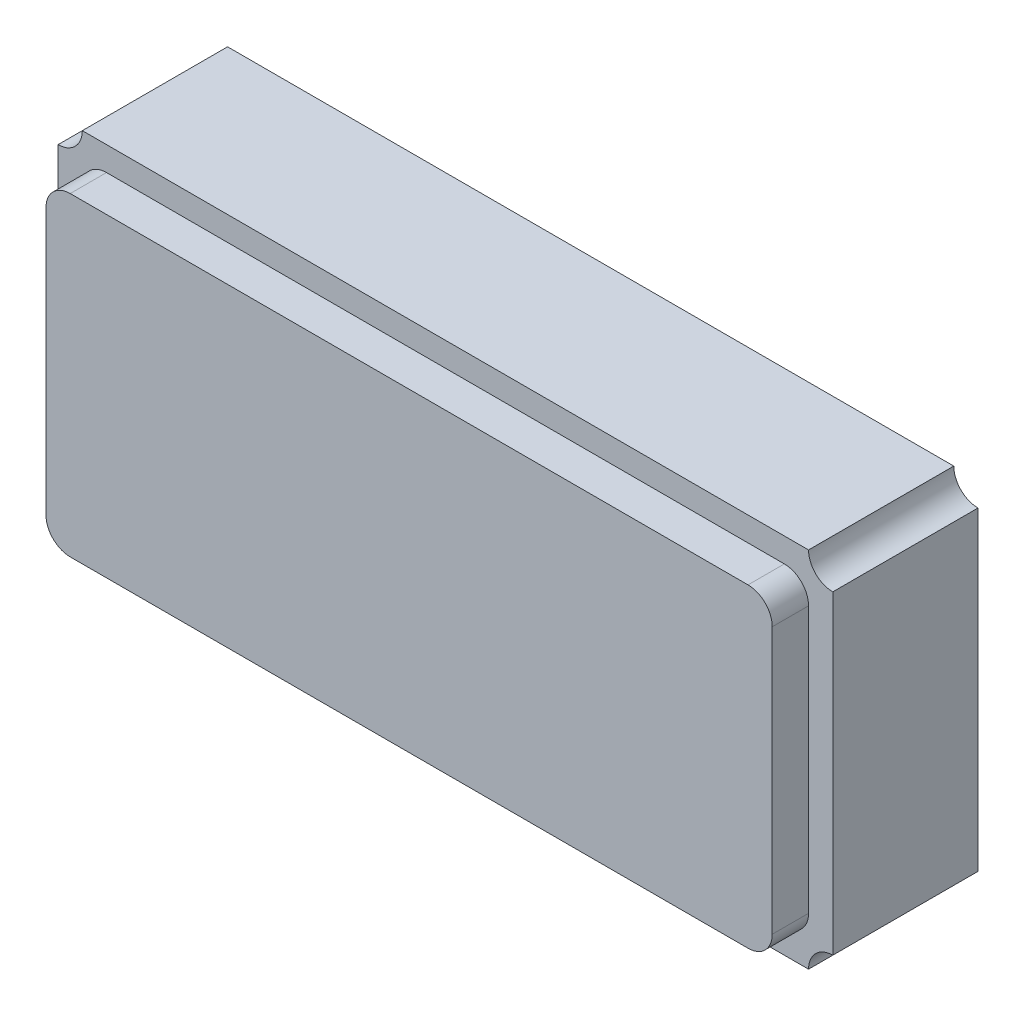
ISO-10303-21;
HEADER;
FILE_DESCRIPTION(('STEP AP214'),'2;1');
FILE_NAME('part.step','',(''),(''),'','','');
FILE_SCHEMA(('AUTOMOTIVE_DESIGN { 1 0 10303 214 1 1 1 1 }'));
ENDSEC;
DATA;
#1=APPLICATION_CONTEXT('core data for automotive mechanical design processes');
#2=APPLICATION_PROTOCOL_DEFINITION('international standard','automotive_design',2000,#1);
#3=PRODUCT_CONTEXT('',#1,'mechanical');
#4=PRODUCT('Part','Part','',(#3));
#5=PRODUCT_RELATED_PRODUCT_CATEGORY('part','',(#4));
#6=PRODUCT_DEFINITION_FORMATION('','',#4);
#7=PRODUCT_DEFINITION_CONTEXT('part definition',#1,'design');
#8=PRODUCT_DEFINITION('design','',#6,#7);
#9=PRODUCT_DEFINITION_SHAPE('','',#8);
#10=(LENGTH_UNIT() NAMED_UNIT(*) SI_UNIT(.MILLI.,.METRE.));
#11=(NAMED_UNIT(*) PLANE_ANGLE_UNIT() SI_UNIT($,.RADIAN.));
#12=(NAMED_UNIT(*) SI_UNIT($,.STERADIAN.) SOLID_ANGLE_UNIT());
#13=UNCERTAINTY_MEASURE_WITH_UNIT(LENGTH_MEASURE(1.E-05),#10,'distance_accuracy_value','');
#14=(GEOMETRIC_REPRESENTATION_CONTEXT(3) GLOBAL_UNCERTAINTY_ASSIGNED_CONTEXT((#13)) GLOBAL_UNIT_ASSIGNED_CONTEXT((#10,
#11,#12)) REPRESENTATION_CONTEXT('',''));
#15=CARTESIAN_POINT('',(0.,0.,0.));
#16=DIRECTION('',(0.,0.,1.));
#17=DIRECTION('',(1.,0.,0.));
#18=AXIS2_PLACEMENT_3D('',#15,#16,#17);
#19=CARTESIAN_POINT('',(3.20000571813639,2.04364228718976E-10,0.6));
#20=DIRECTION('',(0.,0.,-1.));
#21=DIRECTION('',(-1.,0.,0.));
#22=AXIS2_PLACEMENT_3D('',#19,#20,#21);
#23=PLANE('',#22);
#24=CARTESIAN_POINT('',(3.20000571813639,2.04364228718976E-10,0.6));
#25=DIRECTION('',(0.,0.,-1.));
#26=DIRECTION('',(-1.,0.,0.));
#27=AXIS2_PLACEMENT_3D('',#24,#25,#26);
#28=CIRCLE('',#27,0.099997140931804);
#29=CARTESIAN_POINT('',(3.10000857720459,0.,0.6));
#30=VERTEX_POINT('',#29);
#31=CARTESIAN_POINT('',(3.20000285902466,0.0999971410952943,0.6));
#32=VERTEX_POINT('',#31);
#33=EDGE_CURVE('E156',#30,#32,#28,.T.);
#34=ORIENTED_EDGE('',*,*,#33,.T.);
#35=DIRECTION('',(0.,1.,0.));
#36=VECTOR('',#35,1.);
#37=CARTESIAN_POINT('',(3.20000285902466,0.0999971410952943,0.6));
#38=LINE('',#37,#36);
#39=CARTESIAN_POINT('',(3.20000285902466,1.40000285910907,0.6));
#40=VERTEX_POINT('',#39);
#41=EDGE_CURVE('E145',#32,#40,#38,.T.);
#42=ORIENTED_EDGE('',*,*,#41,.T.);
#43=CARTESIAN_POINT('',(3.2,1.5,0.6));
#44=DIRECTION('',(0.,0.,-1.));
#45=DIRECTION('',(-1.,0.,0.));
#46=AXIS2_PLACEMENT_3D('',#43,#44,#45);
#47=CIRCLE('',#46,0.0999971409318037);
#48=CARTESIAN_POINT('',(3.1000028590682,1.5,0.6));
#49=VERTEX_POINT('',#48);
#50=EDGE_CURVE('E155',#40,#49,#47,.T.);
#51=ORIENTED_EDGE('',*,*,#50,.T.);
#52=DIRECTION('',(-1.,0.,0.));
#53=VECTOR('',#52,1.);
#54=CARTESIAN_POINT('',(0.100002859068196,1.5,0.6));
#55=LINE('',#54,#53);
#56=CARTESIAN_POINT('',(0.100002859068196,1.5,0.6));
#57=VERTEX_POINT('',#56);
#58=EDGE_CURVE('E243',#49,#57,#55,.T.);
#59=ORIENTED_EDGE('',*,*,#58,.T.);
#60=CARTESIAN_POINT('',(0.,1.5,0.6));
#61=DIRECTION('',(0.,0.,-1.));
#62=DIRECTION('',(-1.,0.,0.));
#63=AXIS2_PLACEMENT_3D('',#60,#61,#62);
#64=CIRCLE('',#63,0.100002859068196);
#65=CARTESIAN_POINT('',(0.,1.3999971409318,0.6));
#66=VERTEX_POINT('',#65);
#67=EDGE_CURVE('E245',#57,#66,#64,.T.);
#68=ORIENTED_EDGE('',*,*,#67,.T.);
#69=DIRECTION('',(0.,-1.,0.));
#70=VECTOR('',#69,1.);
#71=CARTESIAN_POINT('',(0.,0.0999971409318039,0.6));
#72=LINE('',#71,#70);
#73=CARTESIAN_POINT('',(0.,0.0999971409318039,0.6));
#74=VERTEX_POINT('',#73);
#75=EDGE_CURVE('E247',#66,#74,#72,.T.);
#76=ORIENTED_EDGE('',*,*,#75,.T.);
#77=CARTESIAN_POINT('',(0.,0.,0.6));
#78=DIRECTION('',(0.,0.,-1.));
#79=DIRECTION('',(1.,0.,0.));
#80=AXIS2_PLACEMENT_3D('',#77,#78,#79);
#81=CIRCLE('',#80,0.0999971409318039);
#82=CARTESIAN_POINT('',(0.0999971409318039,0.,0.6));
#83=VERTEX_POINT('',#82);
#84=EDGE_CURVE('E249',#74,#83,#81,.T.);
#85=ORIENTED_EDGE('',*,*,#84,.T.);
#86=DIRECTION('',(1.,0.,0.));
#87=VECTOR('',#86,1.);
#88=CARTESIAN_POINT('',(0.0999971409318039,0.,0.6));
#89=LINE('',#88,#87);
#90=EDGE_CURVE('E160',#83,#30,#89,.T.);
#91=ORIENTED_EDGE('',*,*,#90,.T.);
#92=EDGE_LOOP('',(#34,#42,#51,#59,#68,#76,#85,#91));
#93=FACE_BOUND('',#92,.T.);
#94=DIRECTION('',(0.,-1.,0.));
#95=VECTOR('',#94,1.);
#96=CARTESIAN_POINT('',(0.100002859068196,1.3999971409318,0.6));
#97=LINE('',#96,#95);
#98=CARTESIAN_POINT('',(0.100002859068196,1.2999971409318,0.6));
#99=VERTEX_POINT('',#98);
#100=CARTESIAN_POINT('',(0.100002859068196,0.199997140931803,0.6));
#101=VERTEX_POINT('',#100);
#102=EDGE_CURVE('E206',#99,#101,#97,.T.);
#103=ORIENTED_EDGE('',*,*,#102,.F.);
#104=CARTESIAN_POINT('',(0.200002859068196,1.2999971409318,0.6));
#105=DIRECTION('',(0.,0.,-1.));
#106=DIRECTION('',(-1.,0.,0.));
#107=AXIS2_PLACEMENT_3D('',#104,#105,#106);
#108=CIRCLE('',#107,0.1);
#109=CARTESIAN_POINT('',(0.200002859068196,1.3999971409318,0.6));
#110=VERTEX_POINT('',#109);
#111=EDGE_CURVE('E203',#99,#110,#108,.T.);
#112=ORIENTED_EDGE('',*,*,#111,.T.);
#113=DIRECTION('',(-1.,0.,0.));
#114=VECTOR('',#113,1.);
#115=CARTESIAN_POINT('',(0.100002859068196,1.3999971409318,0.6));
#116=LINE('',#115,#114);
#117=CARTESIAN_POINT('',(3.0000028590682,1.3999971409318,0.6));
#118=VERTEX_POINT('',#117);
#119=EDGE_CURVE('E231',#118,#110,#116,.T.);
#120=ORIENTED_EDGE('',*,*,#119,.F.);
#121=CARTESIAN_POINT('',(3.0000028590682,1.2999971409318,0.6));
#122=DIRECTION('',(0.,0.,-1.));
#123=DIRECTION('',(-1.,0.,0.));
#124=AXIS2_PLACEMENT_3D('',#121,#122,#123);
#125=CIRCLE('',#124,0.1);
#126=CARTESIAN_POINT('',(3.1000028590682,1.2999971409318,0.6));
#127=VERTEX_POINT('',#126);
#128=EDGE_CURVE('E201',#118,#127,#125,.T.);
#129=ORIENTED_EDGE('',*,*,#128,.T.);
#130=DIRECTION('',(0.,1.,0.));
#131=VECTOR('',#130,1.);
#132=CARTESIAN_POINT('',(3.1000028590682,1.3999971409318,0.6));
#133=LINE('',#132,#131);
#134=CARTESIAN_POINT('',(3.1000028590682,0.199997140931804,0.6));
#135=VERTEX_POINT('',#134);
#136=EDGE_CURVE('E237',#135,#127,#133,.T.);
#137=ORIENTED_EDGE('',*,*,#136,.F.);
#138=CARTESIAN_POINT('',(3.0000028590682,0.199997140931804,0.6));
#139=DIRECTION('',(0.,0.,-1.));
#140=DIRECTION('',(-1.,0.,0.));
#141=AXIS2_PLACEMENT_3D('',#138,#139,#140);
#142=CIRCLE('',#141,0.1);
#143=CARTESIAN_POINT('',(3.0000028590682,0.099997140931804,0.6));
#144=VERTEX_POINT('',#143);
#145=EDGE_CURVE('E11',#135,#144,#142,.T.);
#146=ORIENTED_EDGE('',*,*,#145,.T.);
#147=DIRECTION('',(1.,0.,0.));
#148=VECTOR('',#147,1.);
#149=CARTESIAN_POINT('',(0.100002859068196,0.0999971409318033,0.6));
#150=LINE('',#149,#148);
#151=CARTESIAN_POINT('',(0.200002859068196,0.0999971409318033,0.6));
#152=VERTEX_POINT('',#151);
#153=EDGE_CURVE('E207',#152,#144,#150,.T.);
#154=ORIENTED_EDGE('',*,*,#153,.F.);
#155=CARTESIAN_POINT('',(0.200002859068196,0.199997140931803,0.6));
#156=DIRECTION('',(0.,0.,-1.));
#157=DIRECTION('',(-1.,0.,0.));
#158=AXIS2_PLACEMENT_3D('',#155,#156,#157);
#159=CIRCLE('',#158,0.1);
#160=EDGE_CURVE('E41',#152,#101,#159,.T.);
#161=ORIENTED_EDGE('',*,*,#160,.T.);
#162=EDGE_LOOP('',(#103,#112,#120,#129,#137,#146,#154,#161));
#163=FACE_BOUND('',#162,.T.);
#164=ADVANCED_FACE('F33',(#93,#163),#23,.F.);
#165=CARTESIAN_POINT('',(3.20000571813639,2.04364228718976E-10,0.6));
#166=DIRECTION('',(0.,0.,-1.));
#167=DIRECTION('',(-1.,0.,0.));
#168=AXIS2_PLACEMENT_3D('',#165,#166,#167);
#169=CYLINDRICAL_SURFACE('',#168,0.099997140931804);
#170=CARTESIAN_POINT('',(3.20000571813639,2.04364228718976E-10,0.));
#171=DIRECTION('',(0.,0.,-1.));
#172=DIRECTION('',(-1.,0.,0.));
#173=AXIS2_PLACEMENT_3D('',#170,#171,#172);
#174=CIRCLE('',#173,0.099997140931804);
#175=CARTESIAN_POINT('',(3.10000857720459,0.,0.));
#176=VERTEX_POINT('',#175);
#177=CARTESIAN_POINT('',(3.20000285902466,0.0999971410952943,0.));
#178=VERTEX_POINT('',#177);
#179=EDGE_CURVE('E168',#176,#178,#174,.T.);
#180=ORIENTED_EDGE('',*,*,#179,.T.);
#181=DIRECTION('',(0.,0.,-1.));
#182=VECTOR('',#181,1.);
#183=CARTESIAN_POINT('',(3.20000285902466,0.0999971410952943,0.6));
#184=LINE('',#183,#182);
#185=EDGE_CURVE('E149',#32,#178,#184,.T.);
#186=ORIENTED_EDGE('',*,*,#185,.F.);
#187=ORIENTED_EDGE('',*,*,#33,.F.);
#188=DIRECTION('',(0.,0.,-1.));
#189=VECTOR('',#188,1.);
#190=CARTESIAN_POINT('',(3.10000857720459,0.,0.6));
#191=LINE('',#190,#189);
#192=EDGE_CURVE('E252',#30,#176,#191,.T.);
#193=ORIENTED_EDGE('',*,*,#192,.T.);
#194=EDGE_LOOP('',(#180,#186,#187,#193));
#195=FACE_BOUND('',#194,.T.);
#196=ADVANCED_FACE('F166',(#195),#169,.F.);
#197=CARTESIAN_POINT('',(3.20000285902466,0.0999971410952943,0.6));
#198=DIRECTION('',(-1.,0.,0.));
#199=DIRECTION('',(0.,0.,1.));
#200=AXIS2_PLACEMENT_3D('',#197,#198,#199);
#201=PLANE('',#200);
#202=DIRECTION('',(0.,1.,0.));
#203=VECTOR('',#202,1.);
#204=CARTESIAN_POINT('',(3.20000285902466,0.0999971410952943,0.));
#205=LINE('',#204,#203);
#206=CARTESIAN_POINT('',(3.20000285902466,1.40000285910907,0.));
#207=VERTEX_POINT('',#206);
#208=EDGE_CURVE('E254',#178,#207,#205,.T.);
#209=ORIENTED_EDGE('',*,*,#208,.T.);
#210=DIRECTION('',(0.,0.,-1.));
#211=VECTOR('',#210,1.);
#212=CARTESIAN_POINT('',(3.20000285902466,1.40000285910907,0.6));
#213=LINE('',#212,#211);
#214=EDGE_CURVE('E152',#40,#207,#213,.T.);
#215=ORIENTED_EDGE('',*,*,#214,.F.);
#216=ORIENTED_EDGE('',*,*,#41,.F.);
#217=ORIENTED_EDGE('',*,*,#185,.T.);
#218=EDGE_LOOP('',(#209,#215,#216,#217));
#219=FACE_BOUND('',#218,.T.);
#220=ADVANCED_FACE('F147',(#219),#201,.F.);
#221=CARTESIAN_POINT('',(3.2,1.5,0.6));
#222=DIRECTION('',(0.,0.,-1.));
#223=DIRECTION('',(-1.,0.,0.));
#224=AXIS2_PLACEMENT_3D('',#221,#222,#223);
#225=CYLINDRICAL_SURFACE('',#224,0.0999971409318037);
#226=CARTESIAN_POINT('',(3.2,1.5,0.));
#227=DIRECTION('',(0.,0.,-1.));
#228=DIRECTION('',(-1.,0.,0.));
#229=AXIS2_PLACEMENT_3D('',#226,#227,#228);
#230=CIRCLE('',#229,0.0999971409318037);
#231=CARTESIAN_POINT('',(3.1000028590682,1.5,0.));
#232=VERTEX_POINT('',#231);
#233=EDGE_CURVE('E256',#207,#232,#230,.T.);
#234=ORIENTED_EDGE('',*,*,#233,.T.);
#235=DIRECTION('',(0.,0.,-1.));
#236=VECTOR('',#235,1.);
#237=CARTESIAN_POINT('',(3.1000028590682,1.5,0.6));
#238=LINE('',#237,#236);
#239=EDGE_CURVE('E173',#49,#232,#238,.T.);
#240=ORIENTED_EDGE('',*,*,#239,.F.);
#241=ORIENTED_EDGE('',*,*,#50,.F.);
#242=ORIENTED_EDGE('',*,*,#214,.T.);
#243=EDGE_LOOP('',(#234,#240,#241,#242));
#244=FACE_BOUND('',#243,.T.);
#245=ADVANCED_FACE('F303',(#244),#225,.F.);
#246=CARTESIAN_POINT('',(0.100002859068196,1.5,0.6));
#247=DIRECTION('',(0.,-1.,0.));
#248=DIRECTION('',(1.,0.,0.));
#249=AXIS2_PLACEMENT_3D('',#246,#247,#248);
#250=PLANE('',#249);
#251=DIRECTION('',(-1.,0.,0.));
#252=VECTOR('',#251,1.);
#253=CARTESIAN_POINT('',(0.100002859068196,1.5,0.));
#254=LINE('',#253,#252);
#255=CARTESIAN_POINT('',(0.100002859068196,1.5,0.));
#256=VERTEX_POINT('',#255);
#257=EDGE_CURVE('E258',#232,#256,#254,.T.);
#258=ORIENTED_EDGE('',*,*,#257,.T.);
#259=DIRECTION('',(0.,0.,-1.));
#260=VECTOR('',#259,1.);
#261=CARTESIAN_POINT('',(0.100002859068196,1.5,0.6));
#262=LINE('',#261,#260);
#263=EDGE_CURVE('E277',#57,#256,#262,.T.);
#264=ORIENTED_EDGE('',*,*,#263,.F.);
#265=ORIENTED_EDGE('',*,*,#58,.F.);
#266=ORIENTED_EDGE('',*,*,#239,.T.);
#267=EDGE_LOOP('',(#258,#264,#265,#266));
#268=FACE_BOUND('',#267,.T.);
#269=ADVANCED_FACE('F284',(#268),#250,.F.);
#270=CARTESIAN_POINT('',(0.,1.5,0.6));
#271=DIRECTION('',(0.,0.,-1.));
#272=DIRECTION('',(-1.,0.,0.));
#273=AXIS2_PLACEMENT_3D('',#270,#271,#272);
#274=CYLINDRICAL_SURFACE('',#273,0.100002859068196);
#275=CARTESIAN_POINT('',(0.,1.5,0.));
#276=DIRECTION('',(0.,0.,-1.));
#277=DIRECTION('',(-1.,0.,0.));
#278=AXIS2_PLACEMENT_3D('',#275,#276,#277);
#279=CIRCLE('',#278,0.100002859068196);
#280=CARTESIAN_POINT('',(0.,1.3999971409318,0.));
#281=VERTEX_POINT('',#280);
#282=EDGE_CURVE('E260',#256,#281,#279,.T.);
#283=ORIENTED_EDGE('',*,*,#282,.T.);
#284=DIRECTION('',(0.,0.,-1.));
#285=VECTOR('',#284,1.);
#286=CARTESIAN_POINT('',(0.,1.3999971409318,0.6));
#287=LINE('',#286,#285);
#288=EDGE_CURVE('E274',#66,#281,#287,.T.);
#289=ORIENTED_EDGE('',*,*,#288,.F.);
#290=ORIENTED_EDGE('',*,*,#67,.F.);
#291=ORIENTED_EDGE('',*,*,#263,.T.);
#292=EDGE_LOOP('',(#283,#289,#290,#291));
#293=FACE_BOUND('',#292,.T.);
#294=ADVANCED_FACE('F295',(#293),#274,.F.);
#295=CARTESIAN_POINT('',(0.,0.0999971409318039,0.6));
#296=DIRECTION('',(1.,0.,0.));
#297=DIRECTION('',(0.,0.,-1.));
#298=AXIS2_PLACEMENT_3D('',#295,#296,#297);
#299=PLANE('',#298);
#300=DIRECTION('',(0.,-1.,0.));
#301=VECTOR('',#300,1.);
#302=CARTESIAN_POINT('',(0.,0.0999971409318039,0.));
#303=LINE('',#302,#301);
#304=CARTESIAN_POINT('',(0.,0.0999971409318039,0.));
#305=VERTEX_POINT('',#304);
#306=EDGE_CURVE('E262',#281,#305,#303,.T.);
#307=ORIENTED_EDGE('',*,*,#306,.T.);
#308=DIRECTION('',(0.,0.,-1.));
#309=VECTOR('',#308,1.);
#310=CARTESIAN_POINT('',(0.,0.0999971409318039,0.6));
#311=LINE('',#310,#309);
#312=EDGE_CURVE('E271',#74,#305,#311,.T.);
#313=ORIENTED_EDGE('',*,*,#312,.F.);
#314=ORIENTED_EDGE('',*,*,#75,.F.);
#315=ORIENTED_EDGE('',*,*,#288,.T.);
#316=EDGE_LOOP('',(#307,#313,#314,#315));
#317=FACE_BOUND('',#316,.T.);
#318=ADVANCED_FACE('F299',(#317),#299,.F.);
#319=CARTESIAN_POINT('',(0.,0.,0.6));
#320=DIRECTION('',(0.,0.,-1.));
#321=DIRECTION('',(-1.,0.,0.));
#322=AXIS2_PLACEMENT_3D('',#319,#320,#321);
#323=CYLINDRICAL_SURFACE('',#322,0.0999971409318039);
#324=CARTESIAN_POINT('',(0.,0.,0.));
#325=DIRECTION('',(0.,0.,-1.));
#326=DIRECTION('',(1.,0.,0.));
#327=AXIS2_PLACEMENT_3D('',#324,#325,#326);
#328=CIRCLE('',#327,0.0999971409318039);
#329=CARTESIAN_POINT('',(0.0999971409318039,0.,0.));
#330=VERTEX_POINT('',#329);
#331=EDGE_CURVE('E264',#305,#330,#328,.T.);
#332=ORIENTED_EDGE('',*,*,#331,.T.);
#333=DIRECTION('',(0.,0.,-1.));
#334=VECTOR('',#333,1.);
#335=CARTESIAN_POINT('',(0.0999971409318039,0.,0.6));
#336=LINE('',#335,#334);
#337=EDGE_CURVE('E268',#83,#330,#336,.T.);
#338=ORIENTED_EDGE('',*,*,#337,.F.);
#339=ORIENTED_EDGE('',*,*,#84,.F.);
#340=ORIENTED_EDGE('',*,*,#312,.T.);
#341=EDGE_LOOP('',(#332,#338,#339,#340));
#342=FACE_BOUND('',#341,.T.);
#343=ADVANCED_FACE('F326',(#342),#323,.F.);
#344=CARTESIAN_POINT('',(0.0999971409318039,0.,0.6));
#345=DIRECTION('',(0.,1.,0.));
#346=DIRECTION('',(-1.,0.,0.));
#347=AXIS2_PLACEMENT_3D('',#344,#345,#346);
#348=PLANE('',#347);
#349=DIRECTION('',(1.,0.,0.));
#350=VECTOR('',#349,1.);
#351=CARTESIAN_POINT('',(0.0999971409318039,0.,0.));
#352=LINE('',#351,#350);
#353=EDGE_CURVE('E164',#330,#176,#352,.T.);
#354=ORIENTED_EDGE('',*,*,#353,.T.);
#355=ORIENTED_EDGE('',*,*,#192,.F.);
#356=ORIENTED_EDGE('',*,*,#90,.F.);
#357=ORIENTED_EDGE('',*,*,#337,.T.);
#358=EDGE_LOOP('',(#354,#355,#356,#357));
#359=FACE_BOUND('',#358,.T.);
#360=ADVANCED_FACE('F323',(#359),#348,.F.);
#361=CARTESIAN_POINT('',(3.20000571813639,2.04364228718976E-10,0.));
#362=DIRECTION('',(0.,0.,-1.));
#363=DIRECTION('',(-1.,0.,0.));
#364=AXIS2_PLACEMENT_3D('',#361,#362,#363);
#365=PLANE('',#364);
#366=ORIENTED_EDGE('',*,*,#179,.F.);
#367=ORIENTED_EDGE('',*,*,#353,.F.);
#368=ORIENTED_EDGE('',*,*,#331,.F.);
#369=ORIENTED_EDGE('',*,*,#306,.F.);
#370=ORIENTED_EDGE('',*,*,#282,.F.);
#371=ORIENTED_EDGE('',*,*,#257,.F.);
#372=ORIENTED_EDGE('',*,*,#233,.F.);
#373=ORIENTED_EDGE('',*,*,#208,.F.);
#374=EDGE_LOOP('',(#366,#367,#368,#369,#370,#371,#372,#373));
#375=FACE_BOUND('',#374,.T.);
#376=ADVANCED_FACE('F290',(#375),#365,.T.);
#377=CARTESIAN_POINT('',(0.100002859068196,1.3999971409318,0.75));
#378=DIRECTION('',(1.,0.,0.));
#379=DIRECTION('',(0.,1.,0.));
#380=AXIS2_PLACEMENT_3D('',#377,#378,#379);
#381=PLANE('',#380);
#382=DIRECTION('',(0.,-1.,0.));
#383=VECTOR('',#382,1.);
#384=CARTESIAN_POINT('',(0.100002859068196,1.3999971409318,0.75));
#385=LINE('',#384,#383);
#386=CARTESIAN_POINT('',(0.100002859068196,1.2999971409318,0.75));
#387=VERTEX_POINT('',#386);
#388=CARTESIAN_POINT('',(0.100002859068196,0.199997140931803,0.75));
#389=VERTEX_POINT('',#388);
#390=EDGE_CURVE('E223',#387,#389,#385,.T.);
#391=ORIENTED_EDGE('',*,*,#390,.F.);
#392=DIRECTION('',(0.,0.,-1.));
#393=VECTOR('',#392,1.);
#394=CARTESIAN_POINT('',(0.100002859068196,1.2999971409318,0.75));
#395=LINE('',#394,#393);
#396=EDGE_CURVE('E194',#387,#99,#395,.T.);
#397=ORIENTED_EDGE('',*,*,#396,.T.);
#398=ORIENTED_EDGE('',*,*,#102,.T.);
#399=DIRECTION('',(0.,0.,-1.));
#400=VECTOR('',#399,1.);
#401=CARTESIAN_POINT('',(0.100002859068196,0.199997140931803,0.75));
#402=LINE('',#401,#400);
#403=EDGE_CURVE('E192',#101,#389,#402,.F.);
#404=ORIENTED_EDGE('',*,*,#403,.T.);
#405=EDGE_LOOP('',(#391,#397,#398,#404));
#406=FACE_BOUND('',#405,.T.);
#407=ADVANCED_FACE('F210',(#406),#381,.F.);
#408=CARTESIAN_POINT('',(0.100002859068196,0.0999971409318033,0.75));
#409=DIRECTION('',(0.,1.,0.));
#410=DIRECTION('',(-1.,0.,0.));
#411=AXIS2_PLACEMENT_3D('',#408,#409,#410);
#412=PLANE('',#411);
#413=DIRECTION('',(1.,0.,0.));
#414=VECTOR('',#413,1.);
#415=CARTESIAN_POINT('',(0.100002859068196,0.0999971409318033,0.75));
#416=LINE('',#415,#414);
#417=CARTESIAN_POINT('',(0.200002859068196,0.0999971409318033,0.75));
#418=VERTEX_POINT('',#417);
#419=CARTESIAN_POINT('',(3.0000028590682,0.099997140931804,0.75));
#420=VERTEX_POINT('',#419);
#421=EDGE_CURVE('E221',#418,#420,#416,.T.);
#422=ORIENTED_EDGE('',*,*,#421,.F.);
#423=DIRECTION('',(0.,0.,-1.));
#424=VECTOR('',#423,1.);
#425=CARTESIAN_POINT('',(0.200002859068196,0.0999971409318033,0.75));
#426=LINE('',#425,#424);
#427=EDGE_CURVE('E199',#418,#152,#426,.T.);
#428=ORIENTED_EDGE('',*,*,#427,.T.);
#429=ORIENTED_EDGE('',*,*,#153,.T.);
#430=DIRECTION('',(0.,0.,-1.));
#431=VECTOR('',#430,1.);
#432=CARTESIAN_POINT('',(3.0000028590682,0.099997140931804,0.75));
#433=LINE('',#432,#431);
#434=EDGE_CURVE('E197',#144,#420,#433,.F.);
#435=ORIENTED_EDGE('',*,*,#434,.T.);
#436=EDGE_LOOP('',(#422,#428,#429,#435));
#437=FACE_BOUND('',#436,.T.);
#438=ADVANCED_FACE('F225',(#437),#412,.F.);
#439=CARTESIAN_POINT('',(3.1000028590682,1.3999971409318,0.75));
#440=DIRECTION('',(-1.,0.,0.));
#441=DIRECTION('',(0.,0.,1.));
#442=AXIS2_PLACEMENT_3D('',#439,#440,#441);
#443=PLANE('',#442);
#444=ORIENTED_EDGE('',*,*,#136,.T.);
#445=DIRECTION('',(0.,0.,-1.));
#446=VECTOR('',#445,1.);
#447=CARTESIAN_POINT('',(3.1000028590682,1.2999971409318,0.75));
#448=LINE('',#447,#446);
#449=CARTESIAN_POINT('',(3.1000028590682,1.2999971409318,0.75));
#450=VERTEX_POINT('',#449);
#451=EDGE_CURVE('E182',#127,#450,#448,.F.);
#452=ORIENTED_EDGE('',*,*,#451,.T.);
#453=DIRECTION('',(0.,1.,0.));
#454=VECTOR('',#453,1.);
#455=CARTESIAN_POINT('',(3.1000028590682,1.3999971409318,0.75));
#456=LINE('',#455,#454);
#457=CARTESIAN_POINT('',(3.1000028590682,0.199997140931804,0.75));
#458=VERTEX_POINT('',#457);
#459=EDGE_CURVE('E227',#458,#450,#456,.T.);
#460=ORIENTED_EDGE('',*,*,#459,.F.);
#461=DIRECTION('',(0.,0.,-1.));
#462=VECTOR('',#461,1.);
#463=CARTESIAN_POINT('',(3.1000028590682,0.199997140931804,0.75));
#464=LINE('',#463,#462);
#465=EDGE_CURVE('E179',#458,#135,#464,.T.);
#466=ORIENTED_EDGE('',*,*,#465,.T.);
#467=EDGE_LOOP('',(#444,#452,#460,#466));
#468=FACE_BOUND('',#467,.T.);
#469=ADVANCED_FACE('F365',(#468),#443,.F.);
#470=CARTESIAN_POINT('',(0.100002859068196,1.3999971409318,0.75));
#471=DIRECTION('',(0.,-1.,0.));
#472=DIRECTION('',(1.,0.,0.));
#473=AXIS2_PLACEMENT_3D('',#470,#471,#472);
#474=PLANE('',#473);
#475=DIRECTION('',(-1.,0.,0.));
#476=VECTOR('',#475,1.);
#477=CARTESIAN_POINT('',(0.100002859068196,1.3999971409318,0.75));
#478=LINE('',#477,#476);
#479=CARTESIAN_POINT('',(3.0000028590682,1.3999971409318,0.75));
#480=VERTEX_POINT('',#479);
#481=CARTESIAN_POINT('',(0.200002859068196,1.3999971409318,0.75));
#482=VERTEX_POINT('',#481);
#483=EDGE_CURVE('E229',#480,#482,#478,.T.);
#484=ORIENTED_EDGE('',*,*,#483,.F.);
#485=DIRECTION('',(0.,0.,-1.));
#486=VECTOR('',#485,1.);
#487=CARTESIAN_POINT('',(3.0000028590682,1.3999971409318,0.75));
#488=LINE('',#487,#486);
#489=EDGE_CURVE('E171',#480,#118,#488,.T.);
#490=ORIENTED_EDGE('',*,*,#489,.T.);
#491=ORIENTED_EDGE('',*,*,#119,.T.);
#492=DIRECTION('',(0.,0.,-1.));
#493=VECTOR('',#492,1.);
#494=CARTESIAN_POINT('',(0.200002859068196,1.3999971409318,0.75));
#495=LINE('',#494,#493);
#496=EDGE_CURVE('E169',#110,#482,#495,.F.);
#497=ORIENTED_EDGE('',*,*,#496,.T.);
#498=EDGE_LOOP('',(#484,#490,#491,#497));
#499=FACE_BOUND('',#498,.T.);
#500=ADVANCED_FACE('F371',(#499),#474,.F.);
#501=CARTESIAN_POINT('',(0.,0.,0.75));
#502=DIRECTION('',(0.,0.,1.));
#503=DIRECTION('',(1.,0.,0.));
#504=AXIS2_PLACEMENT_3D('',#501,#502,#503);
#505=PLANE('',#504);
#506=ORIENTED_EDGE('',*,*,#459,.T.);
#507=CARTESIAN_POINT('',(3.0000028590682,1.2999971409318,0.75));
#508=DIRECTION('',(0.,0.,1.));
#509=DIRECTION('',(1.,0.,0.));
#510=AXIS2_PLACEMENT_3D('',#507,#508,#509);
#511=CIRCLE('',#510,0.1);
#512=EDGE_CURVE('E190',#450,#480,#511,.T.);
#513=ORIENTED_EDGE('',*,*,#512,.T.);
#514=ORIENTED_EDGE('',*,*,#483,.T.);
#515=CARTESIAN_POINT('',(0.200002859068196,1.2999971409318,0.75));
#516=DIRECTION('',(0.,0.,1.));
#517=DIRECTION('',(1.,0.,0.));
#518=AXIS2_PLACEMENT_3D('',#515,#516,#517);
#519=CIRCLE('',#518,0.1);
#520=EDGE_CURVE('E188',#482,#387,#519,.T.);
#521=ORIENTED_EDGE('',*,*,#520,.T.);
#522=ORIENTED_EDGE('',*,*,#390,.T.);
#523=CARTESIAN_POINT('',(0.200002859068196,0.199997140931803,0.75));
#524=DIRECTION('',(0.,0.,1.));
#525=DIRECTION('',(1.,0.,0.));
#526=AXIS2_PLACEMENT_3D('',#523,#524,#525);
#527=CIRCLE('',#526,0.1);
#528=EDGE_CURVE('E186',#389,#418,#527,.T.);
#529=ORIENTED_EDGE('',*,*,#528,.T.);
#530=ORIENTED_EDGE('',*,*,#421,.T.);
#531=CARTESIAN_POINT('',(3.0000028590682,0.199997140931804,0.75));
#532=DIRECTION('',(0.,0.,1.));
#533=DIRECTION('',(1.,0.,0.));
#534=AXIS2_PLACEMENT_3D('',#531,#532,#533);
#535=CIRCLE('',#534,0.1);
#536=EDGE_CURVE('E184',#420,#458,#535,.T.);
#537=ORIENTED_EDGE('',*,*,#536,.T.);
#538=EDGE_LOOP('',(#506,#513,#514,#521,#522,#529,#530,#537));
#539=FACE_BOUND('',#538,.T.);
#540=ADVANCED_FACE('F220',(#539),#505,.T.);
#541=CARTESIAN_POINT('',(3.0000028590682,1.2999971409318,0.75));
#542=DIRECTION('',(0.,0.,-1.));
#543=DIRECTION('',(-1.,0.,0.));
#544=AXIS2_PLACEMENT_3D('',#541,#542,#543);
#545=CYLINDRICAL_SURFACE('',#544,0.1);
#546=ORIENTED_EDGE('',*,*,#512,.F.);
#547=ORIENTED_EDGE('',*,*,#451,.F.);
#548=ORIENTED_EDGE('',*,*,#128,.F.);
#549=ORIENTED_EDGE('',*,*,#489,.F.);
#550=EDGE_LOOP('',(#546,#547,#548,#549));
#551=FACE_BOUND('',#550,.T.);
#552=ADVANCED_FACE('F386',(#551),#545,.T.);
#553=CARTESIAN_POINT('',(0.200002859068196,1.2999971409318,0.75));
#554=DIRECTION('',(0.,0.,-1.));
#555=DIRECTION('',(-1.,0.,0.));
#556=AXIS2_PLACEMENT_3D('',#553,#554,#555);
#557=CYLINDRICAL_SURFACE('',#556,0.1);
#558=ORIENTED_EDGE('',*,*,#520,.F.);
#559=ORIENTED_EDGE('',*,*,#496,.F.);
#560=ORIENTED_EDGE('',*,*,#111,.F.);
#561=ORIENTED_EDGE('',*,*,#396,.F.);
#562=EDGE_LOOP('',(#558,#559,#560,#561));
#563=FACE_BOUND('',#562,.T.);
#564=ADVANCED_FACE('F393',(#563),#557,.T.);
#565=CARTESIAN_POINT('',(0.200002859068196,0.199997140931803,0.75));
#566=DIRECTION('',(0.,0.,-1.));
#567=DIRECTION('',(-1.,0.,0.));
#568=AXIS2_PLACEMENT_3D('',#565,#566,#567);
#569=CYLINDRICAL_SURFACE('',#568,0.1);
#570=ORIENTED_EDGE('',*,*,#528,.F.);
#571=ORIENTED_EDGE('',*,*,#403,.F.);
#572=ORIENTED_EDGE('',*,*,#160,.F.);
#573=ORIENTED_EDGE('',*,*,#427,.F.);
#574=EDGE_LOOP('',(#570,#571,#572,#573));
#575=FACE_BOUND('',#574,.T.);
#576=ADVANCED_FACE('F215',(#575),#569,.T.);
#577=CARTESIAN_POINT('',(3.0000028590682,0.199997140931804,0.75));
#578=DIRECTION('',(0.,0.,-1.));
#579=DIRECTION('',(-1.,0.,0.));
#580=AXIS2_PLACEMENT_3D('',#577,#578,#579);
#581=CYLINDRICAL_SURFACE('',#580,0.1);
#582=ORIENTED_EDGE('',*,*,#536,.F.);
#583=ORIENTED_EDGE('',*,*,#434,.F.);
#584=ORIENTED_EDGE('',*,*,#145,.F.);
#585=ORIENTED_EDGE('',*,*,#465,.F.);
#586=EDGE_LOOP('',(#582,#583,#584,#585));
#587=FACE_BOUND('',#586,.T.);
#588=ADVANCED_FACE('F35',(#587),#581,.T.);
#589=CLOSED_SHELL('',(#164,#196,#220,#245,#269,#294,#318,#343,#360,#376,#407,#438,#469,#500,
#540,#552,#564,#576,#588));
#590=MANIFOLD_SOLID_BREP('B2',#589);
#591=ADVANCED_BREP_SHAPE_REPRESENTATION('',(#18,#590),#14);
#592=SHAPE_DEFINITION_REPRESENTATION(#9,#591);
ENDSEC;
END-ISO-10303-21;
